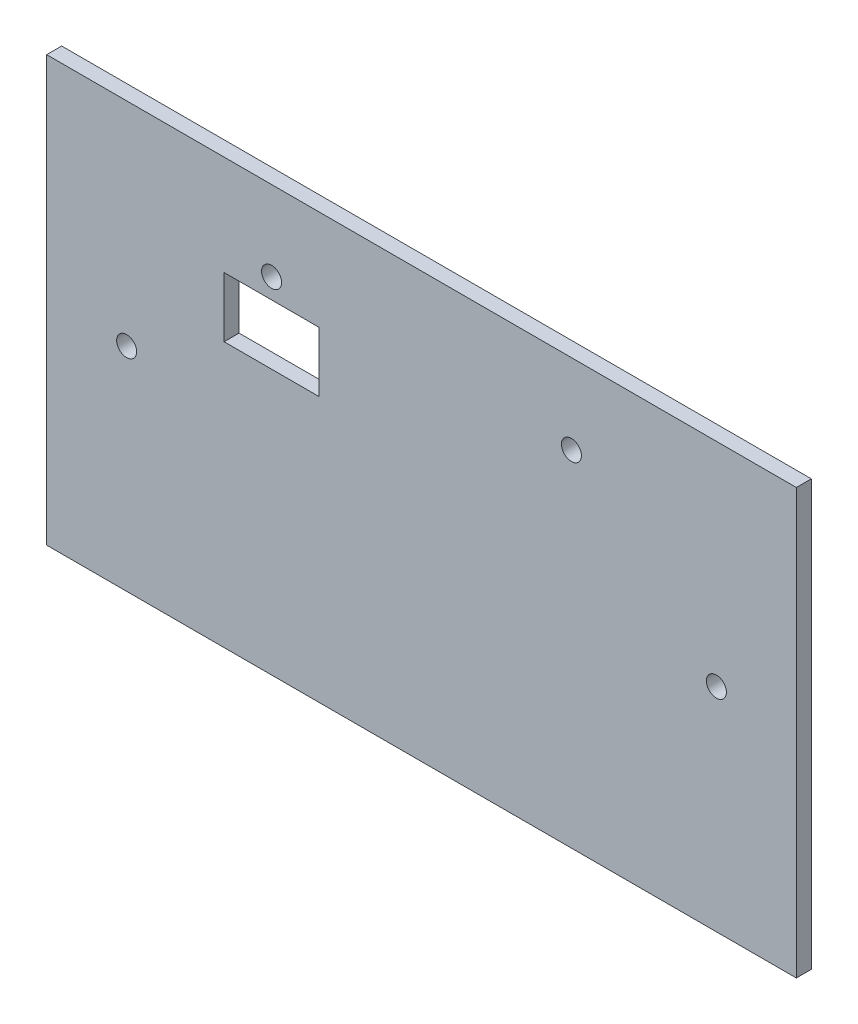
ISO-10303-21;
HEADER;
FILE_DESCRIPTION(('STEP AP214'),'2;1');
FILE_NAME('part.step','',(''),(''),'','','');
FILE_SCHEMA(('AUTOMOTIVE_DESIGN { 1 0 10303 214 1 1 1 1 }'));
ENDSEC;
DATA;
#1=APPLICATION_CONTEXT('core data for automotive mechanical design processes');
#2=APPLICATION_PROTOCOL_DEFINITION('international standard','automotive_design',2000,#1);
#3=PRODUCT_CONTEXT('',#1,'mechanical');
#4=PRODUCT('Part','Part','',(#3));
#5=PRODUCT_RELATED_PRODUCT_CATEGORY('part','',(#4));
#6=PRODUCT_DEFINITION_FORMATION('','',#4);
#7=PRODUCT_DEFINITION_CONTEXT('part definition',#1,'design');
#8=PRODUCT_DEFINITION('design','',#6,#7);
#9=PRODUCT_DEFINITION_SHAPE('','',#8);
#10=(LENGTH_UNIT() NAMED_UNIT(*) SI_UNIT(.MILLI.,.METRE.));
#11=(NAMED_UNIT(*) PLANE_ANGLE_UNIT() SI_UNIT($,.RADIAN.));
#12=(NAMED_UNIT(*) SI_UNIT($,.STERADIAN.) SOLID_ANGLE_UNIT());
#13=UNCERTAINTY_MEASURE_WITH_UNIT(LENGTH_MEASURE(1.E-05),#10,'distance_accuracy_value','');
#14=(GEOMETRIC_REPRESENTATION_CONTEXT(3) GLOBAL_UNCERTAINTY_ASSIGNED_CONTEXT((#13)) GLOBAL_UNIT_ASSIGNED_CONTEXT((#10,
#11,#12)) REPRESENTATION_CONTEXT('',''));
#15=CARTESIAN_POINT('',(0.,0.,0.));
#16=DIRECTION('',(0.,0.,1.));
#17=DIRECTION('',(1.,0.,0.));
#18=AXIS2_PLACEMENT_3D('',#15,#16,#17);
#19=CARTESIAN_POINT('',(75.,42.5,3.));
#20=DIRECTION('',(0.,-1.,0.));
#21=DIRECTION('',(1.,0.,0.));
#22=AXIS2_PLACEMENT_3D('',#19,#20,#21);
#23=PLANE('',#22);
#24=DIRECTION('',(-1.,0.,0.));
#25=VECTOR('',#24,1.);
#26=CARTESIAN_POINT('',(75.,42.5,0.));
#27=LINE('',#26,#25);
#28=CARTESIAN_POINT('',(75.,42.5,0.));
#29=VERTEX_POINT('',#28);
#30=CARTESIAN_POINT('',(-75.,42.5,0.));
#31=VERTEX_POINT('',#30);
#32=EDGE_CURVE('E159',#29,#31,#27,.T.);
#33=ORIENTED_EDGE('',*,*,#32,.T.);
#34=DIRECTION('',(0.,0.,-1.));
#35=VECTOR('',#34,1.);
#36=CARTESIAN_POINT('',(-75.,42.5,3.));
#37=LINE('',#36,#35);
#38=CARTESIAN_POINT('',(-75.,42.5,3.));
#39=VERTEX_POINT('',#38);
#40=EDGE_CURVE('E11',#39,#31,#37,.T.);
#41=ORIENTED_EDGE('',*,*,#40,.F.);
#42=DIRECTION('',(-1.,0.,0.));
#43=VECTOR('',#42,1.);
#44=CARTESIAN_POINT('',(75.,42.5,3.));
#45=LINE('',#44,#43);
#46=CARTESIAN_POINT('',(75.,42.5,3.));
#47=VERTEX_POINT('',#46);
#48=EDGE_CURVE('E160',#47,#39,#45,.T.);
#49=ORIENTED_EDGE('',*,*,#48,.F.);
#50=DIRECTION('',(0.,0.,-1.));
#51=VECTOR('',#50,1.);
#52=CARTESIAN_POINT('',(75.,42.5,3.));
#53=LINE('',#52,#51);
#54=EDGE_CURVE('E172',#47,#29,#53,.T.);
#55=ORIENTED_EDGE('',*,*,#54,.T.);
#56=EDGE_LOOP('',(#33,#41,#49,#55));
#57=FACE_BOUND('',#56,.T.);
#58=ADVANCED_FACE('F35',(#57),#23,.F.);
#59=CARTESIAN_POINT('',(-75.,42.5,3.));
#60=DIRECTION('',(1.,0.,0.));
#61=DIRECTION('',(0.,1.,0.));
#62=AXIS2_PLACEMENT_3D('',#59,#60,#61);
#63=PLANE('',#62);
#64=DIRECTION('',(0.,-1.,0.));
#65=VECTOR('',#64,1.);
#66=CARTESIAN_POINT('',(-75.,42.5,0.));
#67=LINE('',#66,#65);
#68=CARTESIAN_POINT('',(-75.,-42.5,0.));
#69=VERTEX_POINT('',#68);
#70=EDGE_CURVE('E175',#31,#69,#67,.T.);
#71=ORIENTED_EDGE('',*,*,#70,.T.);
#72=DIRECTION('',(0.,0.,-1.));
#73=VECTOR('',#72,1.);
#74=CARTESIAN_POINT('',(-75.,-42.5,3.));
#75=LINE('',#74,#73);
#76=CARTESIAN_POINT('',(-75.,-42.5,3.));
#77=VERTEX_POINT('',#76);
#78=EDGE_CURVE('E42',#77,#69,#75,.T.);
#79=ORIENTED_EDGE('',*,*,#78,.F.);
#80=DIRECTION('',(0.,-1.,0.));
#81=VECTOR('',#80,1.);
#82=CARTESIAN_POINT('',(-75.,42.5,3.));
#83=LINE('',#82,#81);
#84=EDGE_CURVE('E163',#39,#77,#83,.T.);
#85=ORIENTED_EDGE('',*,*,#84,.F.);
#86=ORIENTED_EDGE('',*,*,#40,.T.);
#87=EDGE_LOOP('',(#71,#79,#85,#86));
#88=FACE_BOUND('',#87,.T.);
#89=ADVANCED_FACE('F191',(#88),#63,.F.);
#90=CARTESIAN_POINT('',(75.,-42.5,3.));
#91=DIRECTION('',(0.,-1.,0.));
#92=DIRECTION('',(1.,0.,0.));
#93=AXIS2_PLACEMENT_3D('',#90,#91,#92);
#94=PLANE('',#93);
#95=DIRECTION('',(-1.,0.,0.));
#96=VECTOR('',#95,1.);
#97=CARTESIAN_POINT('',(75.,-42.5,0.));
#98=LINE('',#97,#96);
#99=CARTESIAN_POINT('',(75.,-42.5,0.));
#100=VERTEX_POINT('',#99);
#101=EDGE_CURVE('E178',#100,#69,#98,.T.);
#102=ORIENTED_EDGE('',*,*,#101,.F.);
#103=DIRECTION('',(0.,0.,-1.));
#104=VECTOR('',#103,1.);
#105=CARTESIAN_POINT('',(75.,-42.5,3.));
#106=LINE('',#105,#104);
#107=CARTESIAN_POINT('',(75.,-42.5,3.));
#108=VERTEX_POINT('',#107);
#109=EDGE_CURVE('E184',#108,#100,#106,.T.);
#110=ORIENTED_EDGE('',*,*,#109,.F.);
#111=DIRECTION('',(-1.,0.,0.));
#112=VECTOR('',#111,1.);
#113=CARTESIAN_POINT('',(75.,-42.5,3.));
#114=LINE('',#113,#112);
#115=EDGE_CURVE('E166',#108,#77,#114,.T.);
#116=ORIENTED_EDGE('',*,*,#115,.T.);
#117=ORIENTED_EDGE('',*,*,#78,.T.);
#118=EDGE_LOOP('',(#102,#110,#116,#117));
#119=FACE_BOUND('',#118,.T.);
#120=ADVANCED_FACE('F188',(#119),#94,.T.);
#121=CARTESIAN_POINT('',(75.,42.5,3.));
#122=DIRECTION('',(1.,0.,0.));
#123=DIRECTION('',(0.,1.,0.));
#124=AXIS2_PLACEMENT_3D('',#121,#122,#123);
#125=PLANE('',#124);
#126=DIRECTION('',(0.,-1.,0.));
#127=VECTOR('',#126,1.);
#128=CARTESIAN_POINT('',(75.,42.5,0.));
#129=LINE('',#128,#127);
#130=EDGE_CURVE('E164',#29,#100,#129,.T.);
#131=ORIENTED_EDGE('',*,*,#130,.F.);
#132=ORIENTED_EDGE('',*,*,#54,.F.);
#133=DIRECTION('',(0.,-1.,0.));
#134=VECTOR('',#133,1.);
#135=CARTESIAN_POINT('',(75.,42.5,3.));
#136=LINE('',#135,#134);
#137=EDGE_CURVE('E169',#47,#108,#136,.T.);
#138=ORIENTED_EDGE('',*,*,#137,.T.);
#139=ORIENTED_EDGE('',*,*,#109,.T.);
#140=EDGE_LOOP('',(#131,#132,#138,#139));
#141=FACE_BOUND('',#140,.T.);
#142=ADVANCED_FACE('F197',(#141),#125,.T.);
#143=CARTESIAN_POINT('',(0.,0.,3.));
#144=DIRECTION('',(0.,0.,1.));
#145=DIRECTION('',(1.,0.,0.));
#146=AXIS2_PLACEMENT_3D('',#143,#144,#145);
#147=PLANE('',#146);
#148=DIRECTION('',(0.,-1.,0.));
#149=VECTOR('',#148,1.);
#150=CARTESIAN_POINT('',(-39.5,22.5,3.));
#151=LINE('',#150,#149);
#152=CARTESIAN_POINT('',(-39.5,22.5,3.));
#153=VERTEX_POINT('',#152);
#154=CARTESIAN_POINT('',(-39.5,10.5,3.));
#155=VERTEX_POINT('',#154);
#156=EDGE_CURVE('E49',#153,#155,#151,.T.);
#157=ORIENTED_EDGE('',*,*,#156,.F.);
#158=DIRECTION('',(1.,0.,0.));
#159=VECTOR('',#158,1.);
#160=CARTESIAN_POINT('',(-39.5,22.5,3.));
#161=LINE('',#160,#159);
#162=CARTESIAN_POINT('',(-20.5,22.5,3.));
#163=VERTEX_POINT('',#162);
#164=EDGE_CURVE('E107',#153,#163,#161,.T.);
#165=ORIENTED_EDGE('',*,*,#164,.T.);
#166=DIRECTION('',(0.,-1.,0.));
#167=VECTOR('',#166,1.);
#168=CARTESIAN_POINT('',(-20.5,22.5,3.));
#169=LINE('',#168,#167);
#170=CARTESIAN_POINT('',(-20.5,10.5,3.));
#171=VERTEX_POINT('',#170);
#172=EDGE_CURVE('E127',#163,#171,#169,.T.);
#173=ORIENTED_EDGE('',*,*,#172,.T.);
#174=DIRECTION('',(1.,0.,0.));
#175=VECTOR('',#174,1.);
#176=CARTESIAN_POINT('',(-39.5,10.5,3.));
#177=LINE('',#176,#175);
#178=EDGE_CURVE('E121',#155,#171,#177,.T.);
#179=ORIENTED_EDGE('',*,*,#178,.F.);
#180=EDGE_LOOP('',(#157,#165,#173,#179));
#181=FACE_BOUND('',#180,.T.);
#182=CARTESIAN_POINT('',(59.,0.,3.));
#183=DIRECTION('',(0.,0.,-1.));
#184=DIRECTION('',(-1.,0.,0.));
#185=AXIS2_PLACEMENT_3D('',#182,#183,#184);
#186=CIRCLE('',#185,2.);
#187=CARTESIAN_POINT('',(57.,0.,3.));
#188=VERTEX_POINT('',#187);
#189=EDGE_CURVE('E136',#188,#188,#186,.T.);
#190=ORIENTED_EDGE('',*,*,#189,.T.);
#191=EDGE_LOOP('',(#190));
#192=FACE_BOUND('',#191,.T.);
#193=CARTESIAN_POINT('',(-59.,0.,3.));
#194=DIRECTION('',(0.,0.,1.));
#195=DIRECTION('',(1.,0.,0.));
#196=AXIS2_PLACEMENT_3D('',#193,#194,#195);
#197=CIRCLE('',#196,2.);
#198=CARTESIAN_POINT('',(-57.,0.,3.));
#199=VERTEX_POINT('',#198);
#200=EDGE_CURVE('E139',#199,#199,#197,.T.);
#201=ORIENTED_EDGE('',*,*,#200,.F.);
#202=EDGE_LOOP('',(#201));
#203=FACE_BOUND('',#202,.T.);
#204=CARTESIAN_POINT('',(30.,26.5,3.));
#205=DIRECTION('',(0.,0.,-1.));
#206=DIRECTION('',(-1.,0.,0.));
#207=AXIS2_PLACEMENT_3D('',#204,#205,#206);
#208=CIRCLE('',#207,2.00000000000001);
#209=CARTESIAN_POINT('',(28.,26.5,3.));
#210=VERTEX_POINT('',#209);
#211=EDGE_CURVE('E148',#210,#210,#208,.T.);
#212=ORIENTED_EDGE('',*,*,#211,.T.);
#213=EDGE_LOOP('',(#212));
#214=FACE_BOUND('',#213,.T.);
#215=CARTESIAN_POINT('',(-30.,26.5,3.));
#216=DIRECTION('',(0.,0.,1.));
#217=DIRECTION('',(1.,0.,0.));
#218=AXIS2_PLACEMENT_3D('',#215,#216,#217);
#219=CIRCLE('',#218,2.00000000000001);
#220=CARTESIAN_POINT('',(-28.,26.5,3.));
#221=VERTEX_POINT('',#220);
#222=EDGE_CURVE('E151',#221,#221,#219,.T.);
#223=ORIENTED_EDGE('',*,*,#222,.F.);
#224=EDGE_LOOP('',(#223));
#225=FACE_BOUND('',#224,.T.);
#226=ORIENTED_EDGE('',*,*,#48,.T.);
#227=ORIENTED_EDGE('',*,*,#84,.T.);
#228=ORIENTED_EDGE('',*,*,#115,.F.);
#229=ORIENTED_EDGE('',*,*,#137,.F.);
#230=EDGE_LOOP('',(#226,#227,#228,#229));
#231=FACE_BOUND('',#230,.T.);
#232=ADVANCED_FACE('F201',(#181,#192,#203,#214,#225,#231),#147,.T.);
#233=CARTESIAN_POINT('',(0.,0.,0.));
#234=DIRECTION('',(0.,0.,1.));
#235=DIRECTION('',(1.,0.,0.));
#236=AXIS2_PLACEMENT_3D('',#233,#234,#235);
#237=PLANE('',#236);
#238=DIRECTION('',(-1.,0.,0.));
#239=VECTOR('',#238,1.);
#240=CARTESIAN_POINT('',(-39.5,22.5,0.));
#241=LINE('',#240,#239);
#242=CARTESIAN_POINT('',(-20.5,22.5,0.));
#243=VERTEX_POINT('',#242);
#244=CARTESIAN_POINT('',(-39.5,22.5,0.));
#245=VERTEX_POINT('',#244);
#246=EDGE_CURVE('E119',#243,#245,#241,.T.);
#247=ORIENTED_EDGE('',*,*,#246,.T.);
#248=DIRECTION('',(0.,1.,0.));
#249=VECTOR('',#248,1.);
#250=CARTESIAN_POINT('',(-39.5,22.5,0.));
#251=LINE('',#250,#249);
#252=CARTESIAN_POINT('',(-39.5,10.5,0.));
#253=VERTEX_POINT('',#252);
#254=EDGE_CURVE('E101',#253,#245,#251,.T.);
#255=ORIENTED_EDGE('',*,*,#254,.F.);
#256=DIRECTION('',(-1.,0.,0.));
#257=VECTOR('',#256,1.);
#258=CARTESIAN_POINT('',(-39.5,10.5,0.));
#259=LINE('',#258,#257);
#260=CARTESIAN_POINT('',(-20.5,10.5,0.));
#261=VERTEX_POINT('',#260);
#262=EDGE_CURVE('E110',#261,#253,#259,.T.);
#263=ORIENTED_EDGE('',*,*,#262,.F.);
#264=DIRECTION('',(0.,1.,0.));
#265=VECTOR('',#264,1.);
#266=CARTESIAN_POINT('',(-20.5,22.5,0.));
#267=LINE('',#266,#265);
#268=EDGE_CURVE('E57',#261,#243,#267,.T.);
#269=ORIENTED_EDGE('',*,*,#268,.T.);
#270=EDGE_LOOP('',(#247,#255,#263,#269));
#271=FACE_BOUND('',#270,.T.);
#272=CARTESIAN_POINT('',(59.,0.,0.));
#273=DIRECTION('',(0.,0.,1.));
#274=DIRECTION('',(1.,0.,0.));
#275=AXIS2_PLACEMENT_3D('',#272,#273,#274);
#276=CIRCLE('',#275,2.);
#277=CARTESIAN_POINT('',(61.,0.,0.));
#278=VERTEX_POINT('',#277);
#279=EDGE_CURVE('E113',#278,#278,#276,.T.);
#280=ORIENTED_EDGE('',*,*,#279,.T.);
#281=EDGE_LOOP('',(#280));
#282=FACE_BOUND('',#281,.T.);
#283=CARTESIAN_POINT('',(-59.,0.,0.));
#284=DIRECTION('',(0.,0.,1.));
#285=DIRECTION('',(1.,0.,0.));
#286=AXIS2_PLACEMENT_3D('',#283,#284,#285);
#287=CIRCLE('',#286,2.);
#288=CARTESIAN_POINT('',(-57.,0.,0.));
#289=VERTEX_POINT('',#288);
#290=EDGE_CURVE('E144',#289,#289,#287,.F.);
#291=ORIENTED_EDGE('',*,*,#290,.F.);
#292=EDGE_LOOP('',(#291));
#293=FACE_BOUND('',#292,.T.);
#294=CARTESIAN_POINT('',(30.,26.5,0.));
#295=DIRECTION('',(0.,0.,1.));
#296=DIRECTION('',(1.,0.,0.));
#297=AXIS2_PLACEMENT_3D('',#294,#295,#296);
#298=CIRCLE('',#297,2.00000000000001);
#299=CARTESIAN_POINT('',(32.,26.5,0.));
#300=VERTEX_POINT('',#299);
#301=EDGE_CURVE('E147',#300,#300,#298,.T.);
#302=ORIENTED_EDGE('',*,*,#301,.T.);
#303=EDGE_LOOP('',(#302));
#304=FACE_BOUND('',#303,.T.);
#305=CARTESIAN_POINT('',(-30.,26.5,0.));
#306=DIRECTION('',(0.,0.,1.));
#307=DIRECTION('',(1.,0.,0.));
#308=AXIS2_PLACEMENT_3D('',#305,#306,#307);
#309=CIRCLE('',#308,2.00000000000001);
#310=CARTESIAN_POINT('',(-28.,26.5,0.));
#311=VERTEX_POINT('',#310);
#312=EDGE_CURVE('E156',#311,#311,#309,.F.);
#313=ORIENTED_EDGE('',*,*,#312,.F.);
#314=EDGE_LOOP('',(#313));
#315=FACE_BOUND('',#314,.T.);
#316=ORIENTED_EDGE('',*,*,#32,.F.);
#317=ORIENTED_EDGE('',*,*,#130,.T.);
#318=ORIENTED_EDGE('',*,*,#101,.T.);
#319=ORIENTED_EDGE('',*,*,#70,.F.);
#320=EDGE_LOOP('',(#316,#317,#318,#319));
#321=FACE_BOUND('',#320,.T.);
#322=ADVANCED_FACE('F116',(#271,#282,#293,#304,#315,#321),#237,.F.);
#323=CARTESIAN_POINT('',(-30.,26.5,-0.00100000000000013));
#324=DIRECTION('',(0.,0.,1.));
#325=DIRECTION('',(1.,0.,0.));
#326=AXIS2_PLACEMENT_3D('',#323,#324,#325);
#327=CYLINDRICAL_SURFACE('',#326,2.00000000000001);
#328=ORIENTED_EDGE('',*,*,#222,.T.);
#329=EDGE_LOOP('',(#328));
#330=FACE_BOUND('',#329,.T.);
#331=ORIENTED_EDGE('',*,*,#312,.T.);
#332=EDGE_LOOP('',(#331));
#333=FACE_BOUND('',#332,.T.);
#334=ADVANCED_FACE('F216',(#330,#333),#327,.F.);
#335=CARTESIAN_POINT('',(30.,26.5,-0.00100000000000013));
#336=DIRECTION('',(0.,0.,1.));
#337=DIRECTION('',(1.,0.,0.));
#338=AXIS2_PLACEMENT_3D('',#335,#336,#337);
#339=CYLINDRICAL_SURFACE('',#338,2.00000000000001);
#340=ORIENTED_EDGE('',*,*,#211,.F.);
#341=EDGE_LOOP('',(#340));
#342=FACE_BOUND('',#341,.T.);
#343=ORIENTED_EDGE('',*,*,#301,.F.);
#344=EDGE_LOOP('',(#343));
#345=FACE_BOUND('',#344,.T.);
#346=ADVANCED_FACE('F222',(#342,#345),#339,.F.);
#347=CARTESIAN_POINT('',(-59.,0.,-0.00100000000000013));
#348=DIRECTION('',(0.,0.,1.));
#349=DIRECTION('',(1.,0.,0.));
#350=AXIS2_PLACEMENT_3D('',#347,#348,#349);
#351=CYLINDRICAL_SURFACE('',#350,2.);
#352=ORIENTED_EDGE('',*,*,#200,.T.);
#353=EDGE_LOOP('',(#352));
#354=FACE_BOUND('',#353,.T.);
#355=ORIENTED_EDGE('',*,*,#290,.T.);
#356=EDGE_LOOP('',(#355));
#357=FACE_BOUND('',#356,.T.);
#358=ADVANCED_FACE('F226',(#354,#357),#351,.F.);
#359=CARTESIAN_POINT('',(59.,0.,-0.00100000000000013));
#360=DIRECTION('',(0.,0.,1.));
#361=DIRECTION('',(1.,0.,0.));
#362=AXIS2_PLACEMENT_3D('',#359,#360,#361);
#363=CYLINDRICAL_SURFACE('',#362,2.);
#364=ORIENTED_EDGE('',*,*,#189,.F.);
#365=EDGE_LOOP('',(#364));
#366=FACE_BOUND('',#365,.T.);
#367=ORIENTED_EDGE('',*,*,#279,.F.);
#368=EDGE_LOOP('',(#367));
#369=FACE_BOUND('',#368,.T.);
#370=ADVANCED_FACE('F230',(#366,#369),#363,.F.);
#371=CARTESIAN_POINT('',(-39.5,22.5,-0.00100000000000013));
#372=DIRECTION('',(-1.,0.,0.));
#373=DIRECTION('',(0.,0.,1.));
#374=AXIS2_PLACEMENT_3D('',#371,#372,#373);
#375=PLANE('',#374);
#376=ORIENTED_EDGE('',*,*,#254,.T.);
#377=DIRECTION('',(0.,0.,1.));
#378=VECTOR('',#377,1.);
#379=CARTESIAN_POINT('',(-39.5,22.5,-0.00100000000000013));
#380=LINE('',#379,#378);
#381=EDGE_CURVE('E114',#245,#153,#380,.T.);
#382=ORIENTED_EDGE('',*,*,#381,.T.);
#383=ORIENTED_EDGE('',*,*,#156,.T.);
#384=DIRECTION('',(0.,0.,1.));
#385=VECTOR('',#384,1.);
#386=CARTESIAN_POINT('',(-39.5,10.5,-0.00100000000000013));
#387=LINE('',#386,#385);
#388=EDGE_CURVE('E97',#253,#155,#387,.T.);
#389=ORIENTED_EDGE('',*,*,#388,.F.);
#390=EDGE_LOOP('',(#376,#382,#383,#389));
#391=FACE_BOUND('',#390,.T.);
#392=ADVANCED_FACE('F99',(#391),#375,.F.);
#393=CARTESIAN_POINT('',(-39.5,22.5,-0.00100000000000013));
#394=DIRECTION('',(0.,-1.,0.));
#395=DIRECTION('',(0.,0.,-1.));
#396=AXIS2_PLACEMENT_3D('',#393,#394,#395);
#397=PLANE('',#396);
#398=DIRECTION('',(0.,0.,1.));
#399=VECTOR('',#398,1.);
#400=CARTESIAN_POINT('',(-20.5,22.5,-0.00100000000000013));
#401=LINE('',#400,#399);
#402=EDGE_CURVE('E133',#243,#163,#401,.T.);
#403=ORIENTED_EDGE('',*,*,#402,.T.);
#404=ORIENTED_EDGE('',*,*,#164,.F.);
#405=ORIENTED_EDGE('',*,*,#381,.F.);
#406=ORIENTED_EDGE('',*,*,#246,.F.);
#407=EDGE_LOOP('',(#403,#404,#405,#406));
#408=FACE_BOUND('',#407,.T.);
#409=ADVANCED_FACE('F237',(#408),#397,.T.);
#410=CARTESIAN_POINT('',(-20.5,22.5,-0.00100000000000013));
#411=DIRECTION('',(-1.,0.,0.));
#412=DIRECTION('',(0.,0.,1.));
#413=AXIS2_PLACEMENT_3D('',#410,#411,#412);
#414=PLANE('',#413);
#415=DIRECTION('',(0.,0.,1.));
#416=VECTOR('',#415,1.);
#417=CARTESIAN_POINT('',(-20.5,10.5,-0.00100000000000013));
#418=LINE('',#417,#416);
#419=EDGE_CURVE('E106',#261,#171,#418,.T.);
#420=ORIENTED_EDGE('',*,*,#419,.T.);
#421=ORIENTED_EDGE('',*,*,#172,.F.);
#422=ORIENTED_EDGE('',*,*,#402,.F.);
#423=ORIENTED_EDGE('',*,*,#268,.F.);
#424=EDGE_LOOP('',(#420,#421,#422,#423));
#425=FACE_BOUND('',#424,.T.);
#426=ADVANCED_FACE('F240',(#425),#414,.T.);
#427=CARTESIAN_POINT('',(-39.5,10.5,-0.00100000000000013));
#428=DIRECTION('',(0.,-1.,0.));
#429=DIRECTION('',(0.,0.,-1.));
#430=AXIS2_PLACEMENT_3D('',#427,#428,#429);
#431=PLANE('',#430);
#432=ORIENTED_EDGE('',*,*,#262,.T.);
#433=ORIENTED_EDGE('',*,*,#388,.T.);
#434=ORIENTED_EDGE('',*,*,#178,.T.);
#435=ORIENTED_EDGE('',*,*,#419,.F.);
#436=EDGE_LOOP('',(#432,#433,#434,#435));
#437=FACE_BOUND('',#436,.T.);
#438=ADVANCED_FACE('F111',(#437),#431,.F.);
#439=CLOSED_SHELL('',(#58,#89,#120,#142,#232,#322,#334,#346,#358,#370,#392,#409,#426,#438));
#440=MANIFOLD_SOLID_BREP('B2',#439);
#441=ADVANCED_BREP_SHAPE_REPRESENTATION('',(#18,#440),#14);
#442=SHAPE_DEFINITION_REPRESENTATION(#9,#441);
ENDSEC;
END-ISO-10303-21;
